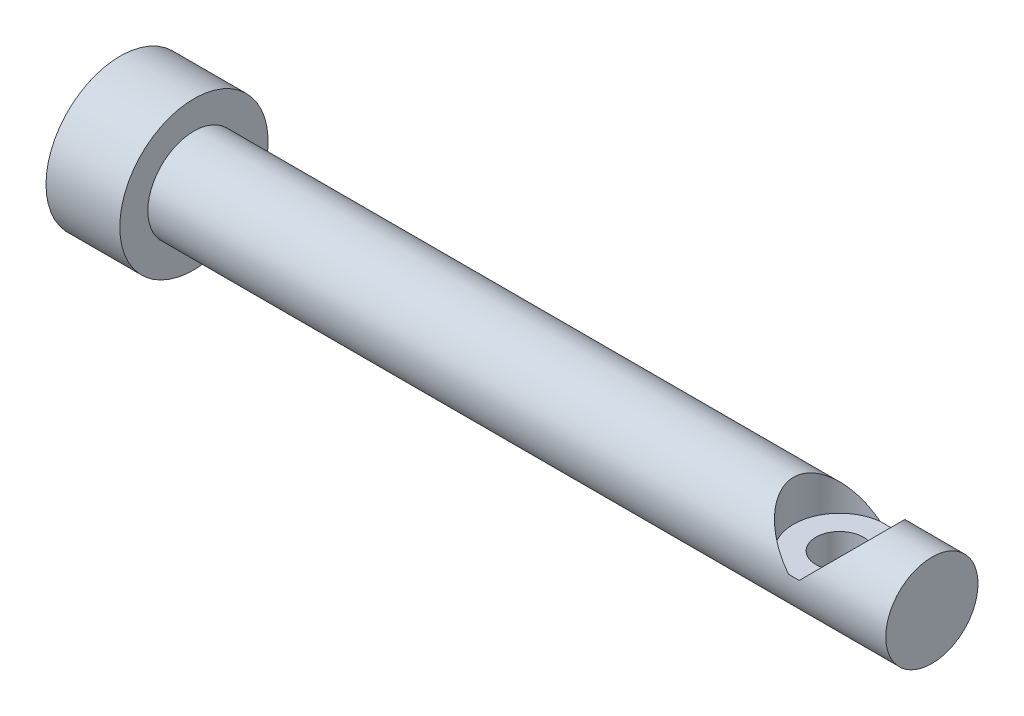
ISO-10303-21;
HEADER;
FILE_DESCRIPTION(('STEP AP214'),'2;1');
FILE_NAME('part.step','',(''),(''),'','','');
FILE_SCHEMA(('AUTOMOTIVE_DESIGN { 1 0 10303 214 1 1 1 1 }'));
ENDSEC;
DATA;
#1=APPLICATION_CONTEXT('core data for automotive mechanical design processes');
#2=APPLICATION_PROTOCOL_DEFINITION('international standard','automotive_design',2000,#1);
#3=PRODUCT_CONTEXT('',#1,'mechanical');
#4=PRODUCT('Part','Part','',(#3));
#5=PRODUCT_RELATED_PRODUCT_CATEGORY('part','',(#4));
#6=PRODUCT_DEFINITION_FORMATION('','',#4);
#7=PRODUCT_DEFINITION_CONTEXT('part definition',#1,'design');
#8=PRODUCT_DEFINITION('design','',#6,#7);
#9=PRODUCT_DEFINITION_SHAPE('','',#8);
#10=(LENGTH_UNIT() NAMED_UNIT(*) SI_UNIT(.MILLI.,.METRE.));
#11=(NAMED_UNIT(*) PLANE_ANGLE_UNIT() SI_UNIT($,.RADIAN.));
#12=(NAMED_UNIT(*) SI_UNIT($,.STERADIAN.) SOLID_ANGLE_UNIT());
#13=UNCERTAINTY_MEASURE_WITH_UNIT(LENGTH_MEASURE(1.E-05),#10,'distance_accuracy_value','');
#14=(GEOMETRIC_REPRESENTATION_CONTEXT(3) GLOBAL_UNCERTAINTY_ASSIGNED_CONTEXT((#13)) GLOBAL_UNIT_ASSIGNED_CONTEXT((#10,
#11,#12)) REPRESENTATION_CONTEXT('',''));
#15=CARTESIAN_POINT('',(0.,0.,0.));
#16=DIRECTION('',(0.,0.,1.));
#17=DIRECTION('',(1.,0.,0.));
#18=AXIS2_PLACEMENT_3D('',#15,#16,#17);
#19=CARTESIAN_POINT('',(-46.0375,40.64,0.));
#20=DIRECTION('',(1.,0.,0.));
#21=DIRECTION('',(0.,0.,-1.));
#22=AXIS2_PLACEMENT_3D('',#19,#20,#21);
#23=PLANE('',#22);
#24=CARTESIAN_POINT('',(-46.0375,40.64,0.));
#25=DIRECTION('',(-1.,0.,0.));
#26=DIRECTION('',(0.,0.,1.));
#27=AXIS2_PLACEMENT_3D('',#24,#25,#26);
#28=CIRCLE('',#27,6.38174999999998);
#29=CARTESIAN_POINT('',(-46.0375,40.64,6.38174999999998));
#30=VERTEX_POINT('',#29);
#31=EDGE_CURVE('E101',#30,#30,#28,.T.);
#32=ORIENTED_EDGE('',*,*,#31,.T.);
#33=EDGE_LOOP('',(#32));
#34=FACE_BOUND('',#33,.T.);
#35=ADVANCED_FACE('F42',(#34),#23,.F.);
#36=CARTESIAN_POINT('',(-56.202964930825,40.64,0.));
#37=DIRECTION('',(-1.,0.,0.));
#38=DIRECTION('',(0.,0.,1.));
#39=AXIS2_PLACEMENT_3D('',#36,#37,#38);
#40=CYLINDRICAL_SURFACE('',#39,6.38174999999998);
#41=ORIENTED_EDGE('',*,*,#31,.F.);
#42=EDGE_LOOP('',(#41));
#43=FACE_BOUND('',#42,.T.);
#44=CARTESIAN_POINT('',(-39.6875,40.64,0.));
#45=DIRECTION('',(-1.,0.,0.));
#46=DIRECTION('',(0.,0.,1.));
#47=AXIS2_PLACEMENT_3D('',#44,#45,#46);
#48=CIRCLE('',#47,6.38174999999998);
#49=CARTESIAN_POINT('',(-39.6875,40.64,6.38174999999998));
#50=VERTEX_POINT('',#49);
#51=EDGE_CURVE('E107',#50,#50,#48,.T.);
#52=ORIENTED_EDGE('',*,*,#51,.T.);
#53=EDGE_LOOP('',(#52));
#54=FACE_BOUND('',#53,.T.);
#55=ADVANCED_FACE('F139',(#43,#54),#40,.T.);
#56=CARTESIAN_POINT('',(-39.6875,47.02175,0.));
#57=DIRECTION('',(-1.,0.,0.));
#58=DIRECTION('',(0.,0.,1.));
#59=AXIS2_PLACEMENT_3D('',#56,#57,#58);
#60=PLANE('',#59);
#61=ORIENTED_EDGE('',*,*,#51,.F.);
#62=EDGE_LOOP('',(#61));
#63=FACE_BOUND('',#62,.T.);
#64=CARTESIAN_POINT('',(-39.6875,40.64,0.));
#65=DIRECTION('',(-1.,0.,0.));
#66=DIRECTION('',(0.,0.,1.));
#67=AXIS2_PLACEMENT_3D('',#64,#65,#66);
#68=CIRCLE('',#67,3.96875);
#69=CARTESIAN_POINT('',(-39.6875,40.64,3.96875));
#70=VERTEX_POINT('',#69);
#71=EDGE_CURVE('E111',#70,#70,#68,.T.);
#72=ORIENTED_EDGE('',*,*,#71,.T.);
#73=EDGE_LOOP('',(#72));
#74=FACE_BOUND('',#73,.T.);
#75=ADVANCED_FACE('F132',(#63,#74),#60,.F.);
#76=CARTESIAN_POINT('',(-56.202964930825,40.64,0.));
#77=DIRECTION('',(-1.,0.,0.));
#78=DIRECTION('',(0.,0.,1.));
#79=AXIS2_PLACEMENT_3D('',#76,#77,#78);
#80=CYLINDRICAL_SURFACE('',#79,3.96875);
#81=CARTESIAN_POINT('',(15.8749999999976,37.2385034951409,2.04469999998323));
#82=CARTESIAN_POINT('',(15.9810296673809,37.2384921446181,2.04469095313278));
#83=CARTESIAN_POINT('',(16.087186049216,37.2334689304662,2.03639610747318));
#84=CARTESIAN_POINT('',(16.296196619013,37.2141166192886,2.00365574002861));
#85=CARTESIAN_POINT('',(16.3990438733391,37.1997691684103,1.97917836285914));
#86=CARTESIAN_POINT('',(16.5980157573345,37.1638826984057,1.91543778523076));
#87=CARTESIAN_POINT('',(16.6941743983987,37.1423838616728,1.87625704619408));
#88=CARTESIAN_POINT('',(16.8785268322763,37.0946797008581,1.78447410838844));
#89=CARTESIAN_POINT('',(16.9667197856267,37.0684738815993,1.73187049728101));
#90=CARTESIAN_POINT('',(17.1411862074223,37.0114993608057,1.60931969969034));
#91=CARTESIAN_POINT('',(17.2266099439618,36.9805320578099,1.53825463857101));
#92=CARTESIAN_POINT('',(17.3849933927587,36.9191232655558,1.38311810546774));
#93=CARTESIAN_POINT('',(17.4579465495138,36.8886820603666,1.29903983671199));
#94=CARTESIAN_POINT('',(17.5945159369457,36.8291123566564,1.11280547865068));
#95=CARTESIAN_POINT('',(17.6570685598794,36.8002399622901,1.00977973458518));
#96=CARTESIAN_POINT('',(17.7635633236914,36.7496725657032,0.792899929535476));
#97=CARTESIAN_POINT('',(17.8075179218486,36.7279727612961,0.679053179441468));
#98=CARTESIAN_POINT('',(17.8721420002705,36.695632650431,0.452781116875787));
#99=CARTESIAN_POINT('',(17.894306878998,36.6842866921271,0.340886083819498));
#100=CARTESIAN_POINT('',(17.9196657820781,36.6712835055659,0.114436436252768));
#101=CARTESIAN_POINT('',(17.9228721094941,36.6696199939409,-0.000116405012391717));
#102=CARTESIAN_POINT('',(17.9107568968359,36.675851831025,-0.217308436998253));
#103=CARTESIAN_POINT('',(17.8971162400228,36.6828800609314,-0.320072337486711));
#104=CARTESIAN_POINT('',(17.85472846694,36.7043716883468,-0.521611273963975));
#105=CARTESIAN_POINT('',(17.8259802134925,36.7188356455555,-0.620386009077913));
#106=CARTESIAN_POINT('',(17.7540561012209,36.7541231749749,-0.812797918909218));
#107=CARTESIAN_POINT('',(17.7106962624683,36.7750275374008,-0.906350890685685));
#108=CARTESIAN_POINT('',(17.6110599043365,36.8213433716821,-1.08506826469671));
#109=CARTESIAN_POINT('',(17.5547788721154,36.846756417529,-1.17022972123312));
#110=CARTESIAN_POINT('',(17.4245314425793,36.9026972596255,-1.33872378517888));
#111=CARTESIAN_POINT('',(17.3493676607973,36.9334823173808,-1.42104595309194));
#112=CARTESIAN_POINT('',(17.1866688453255,36.9951427555445,-1.57247922097055));
#113=CARTESIAN_POINT('',(17.0991233861343,37.0260181903739,-1.64157907104056));
#114=CARTESIAN_POINT('',(16.9066337204245,37.0867566365551,-1.76940511193604));
#115=CARTESIAN_POINT('',(16.8008982674859,37.1163950705032,-1.82705748016625));
#116=CARTESIAN_POINT('',(16.5793736535943,37.1679991456395,-1.92332995323159));
#117=CARTESIAN_POINT('',(16.4635956231188,37.1899731492171,-1.96197081987108));
#118=CARTESIAN_POINT('',(16.2350232726814,37.2212207102512,-2.01589452613062));
#119=CARTESIAN_POINT('',(16.1227388113369,37.2313741259031,-2.03280704003834));
#120=CARTESIAN_POINT('',(15.89650715938,37.2403069028891,-2.0477197651732));
#121=CARTESIAN_POINT('',(15.7825613983416,37.2390955265182,-2.04573537733814));
#122=CARTESIAN_POINT('',(15.570809427422,37.2263712574831,-2.02440636440867));
#123=CARTESIAN_POINT('',(15.472702946485,37.2161078690335,-2.00716660258606));
#124=CARTESIAN_POINT('',(15.2809868701294,37.188330490582,-1.95901019400936));
#125=CARTESIAN_POINT('',(15.1873788676384,37.170813953022,-1.92808874150792));
#126=CARTESIAN_POINT('',(15.0024188199655,37.1295780930162,-1.85198821084725));
#127=CARTESIAN_POINT('',(14.9113656418786,37.1056117713315,-1.80622185245023));
#128=CARTESIAN_POINT('',(14.7376959676823,37.0543702512894,-1.70223225881659));
#129=CARTESIAN_POINT('',(14.6550838484531,37.027093352199,-1.64400260902257));
#130=CARTESIAN_POINT('',(14.4889256677509,36.9678670598767,-1.50753526476157));
#131=CARTESIAN_POINT('',(14.4067688946653,36.9357852350484,-1.42765577686862));
#132=CARTESIAN_POINT('',(14.2565537365266,36.8737200640767,-1.25480860925901));
#133=CARTESIAN_POINT('',(14.1885010799828,36.8437375738571,-1.16183563715841));
#134=CARTESIAN_POINT('',(14.066464796352,36.7879963402883,-0.961355917540092));
#135=CARTESIAN_POINT('',(14.0130168404471,36.7624087239895,-0.853472034547112));
#136=CARTESIAN_POINT('',(13.9255774638542,36.7196731377082,-0.628546536239697));
#137=CARTESIAN_POINT('',(13.8915679506736,36.7025173218481,-0.511513552266631));
#138=CARTESIAN_POINT('',(13.847064186612,36.6799019644443,-0.283630061133085));
#139=CARTESIAN_POINT('',(13.834640035196,36.6734846800949,-0.1732511628982));
#140=CARTESIAN_POINT('',(13.8278726978904,36.6700005904311,0.048190322662984));
#141=CARTESIAN_POINT('',(13.8335223424765,36.6729300774326,0.159252621452301));
#142=CARTESIAN_POINT('',(13.86151318993,36.6872562606117,0.370386422018556));
#143=CARTESIAN_POINT('',(13.8826122208328,36.6980224987448,0.470670300698684));
#144=CARTESIAN_POINT('',(13.9391595757266,36.7262986185031,0.666086288487658));
#145=CARTESIAN_POINT('',(13.9746098421702,36.7438094129945,0.761217698228142));
#146=CARTESIAN_POINT('',(14.0603207302754,36.7849034280803,0.948012762873163));
#147=CARTESIAN_POINT('',(14.1111264133395,36.8087051807866,1.03937675205056));
#148=CARTESIAN_POINT('',(14.2254293464307,36.8599667173967,1.21264251753973));
#149=CARTESIAN_POINT('',(14.288932319184,36.8874281488663,1.29454000089368));
#150=CARTESIAN_POINT('',(14.4345173007882,36.9467221414441,1.45560557197455));
#151=CARTESIAN_POINT('',(14.5178482446944,36.9787113681171,1.53359074406877));
#152=CARTESIAN_POINT('',(14.6967130149886,37.0411809557968,1.67495141726793));
#153=CARTESIAN_POINT('',(14.7922586765726,37.0716598130832,1.73831257945444));
#154=CARTESIAN_POINT('',(14.9980891276404,37.1287257641663,1.85097345038523));
#155=CARTESIAN_POINT('',(15.1088197538069,37.1551000638929,1.89958411553395));
#156=CARTESIAN_POINT('',(15.2810104703394,37.187492195497,1.95745939789621));
#157=CARTESIAN_POINT('',(15.3393685583633,37.1970893266706,1.97423611508808));
#158=CARTESIAN_POINT('',(15.4577033718036,37.2135012529178,2.00258679582263));
#159=CARTESIAN_POINT('',(15.5176789614357,37.220317948793,2.01416431426585));
#160=CARTESIAN_POINT('',(15.6271829091082,37.2298375938362,2.03023117277375));
#161=CARTESIAN_POINT('',(15.6765305850075,37.2330761384499,2.03564943531788));
#162=CARTESIAN_POINT('',(15.7755762024996,37.2374118191843,2.04288608546702));
#163=CARTESIAN_POINT('',(15.8252741662958,37.2385088183134,2.04470424277859));
#164=CARTESIAN_POINT('',(15.8749999999976,37.2385034951409,2.04469999998323));
#165=B_SPLINE_CURVE_WITH_KNOTS('',3,(#81,#82,#83,#84,#85,#86,#87,#88,#89,#90,#91,#92,#93,#94,
#95,#96,#97,#98,#99,#100,#101,#102,#103,#104,#105,#106,#107,#108,#109,#110,#111,#112,#113,#114,
#115,#116,#117,#118,#119,#120,#121,#122,#123,#124,#125,#126,#127,#128,#129,#130,#131,#132,#133,
#134,#135,#136,#137,#138,#139,#140,#141,#142,#143,#144,#145,#146,#147,#148,#149,#150,#151,#152,
#153,#154,#155,#156,#157,#158,#159,#160,#161,#162,#163,#164),.UNSPECIFIED.,.T.,.F.,(4,2,2,2,2,2,
2,2,2,2,2,2,2,2,2,2,2,2,2,2,2,2,2,2,2,2,2,2,2,2,2,2,2,2,2,2,2,2,2,2,2,4),(0.,0.317887197224384,
0.636402027478961,0.953156586014666,1.26994448683744,1.6145706664873,1.95937745491296,
2.32923846287314,2.69885133783553,3.04082603088624,3.38257877667745,3.69282438947972,
4.00309335840678,4.3174248492911,4.63186629070496,4.97734842559369,5.32312321134138,
5.6932585486521,6.06298877174803,6.40296098492941,6.7426561451537,7.04172007117901,
7.34088912807315,7.65373769333344,7.96674766310522,8.32215674363977,8.67770989498329,
9.04494424094496,9.41183622152008,9.74381134271512,10.075654792152,10.3833952855153,
10.6911774457672,11.0115122332062,11.3319917237556,11.6860154254853,12.0403847884743,
12.4093938497264,12.5935710006009,12.7776220297253,12.9266953525869,13.0757782111415),.UNSPECIFIED.);
#166=CARTESIAN_POINT('',(15.8749999999976,37.2385034951409,2.04469999998323));
#167=VERTEX_POINT('',#166);
#168=EDGE_CURVE('E45',#167,#167,#165,.T.);
#169=ORIENTED_EDGE('',*,*,#168,.T.);
#170=EDGE_LOOP('',(#169));
#171=FACE_BOUND('',#170,.T.);
#172=DIRECTION('',(-1.,0.,0.));
#173=VECTOR('',#172,1.);
#174=CARTESIAN_POINT('',(-56.202964930825,41.10355,-3.94158571643444));
#175=LINE('',#174,#173);
#176=CARTESIAN_POINT('',(15.4114499999976,41.10355,-3.94158571644702));
#177=VERTEX_POINT('',#176);
#178=CARTESIAN_POINT('',(16.3385499999976,41.10355,-3.94158571644702));
#179=VERTEX_POINT('',#178);
#180=EDGE_CURVE('E88',#177,#179,#175,.F.);
#181=ORIENTED_EDGE('',*,*,#180,.T.);
#182=CARTESIAN_POINT('',(15.8749999999976,40.64,-8.38565328287189E-12));
#183=DIRECTION('',(-0.707106781186547,0.707106781186547,0.));
#184=DIRECTION('',(-0.707106781186547,-0.707106781186547,0.));
#185=AXIS2_PLACEMENT_3D('',#182,#183,#184);
#186=ELLIPSE('',#185,5.61266007566822,3.96875);
#187=CARTESIAN_POINT('',(16.3385499999976,41.10355,3.94158571642186));
#188=VERTEX_POINT('',#187);
#189=EDGE_CURVE('E11',#179,#188,#186,.F.);
#190=ORIENTED_EDGE('',*,*,#189,.T.);
#191=DIRECTION('',(-1.,0.,0.));
#192=VECTOR('',#191,1.);
#193=CARTESIAN_POINT('',(-56.202964930825,41.10355,3.94158571643444));
#194=LINE('',#193,#192);
#195=CARTESIAN_POINT('',(15.4114499999976,41.10355,3.94158571642186));
#196=VERTEX_POINT('',#195);
#197=EDGE_CURVE('E56',#188,#196,#194,.T.);
#198=ORIENTED_EDGE('',*,*,#197,.T.);
#199=CARTESIAN_POINT('',(15.8749999999976,40.64,-8.38565328287189E-12));
#200=DIRECTION('',(-0.707106781186547,-0.707106781186547,0.));
#201=DIRECTION('',(-0.707106781186547,0.707106781186547,0.));
#202=AXIS2_PLACEMENT_3D('',#199,#200,#201);
#203=ELLIPSE('',#202,5.61266007566822,3.96875);
#204=EDGE_CURVE('E71',#196,#177,#203,.T.);
#205=ORIENTED_EDGE('',*,*,#204,.T.);
#206=EDGE_LOOP('',(#181,#190,#198,#205));
#207=FACE_BOUND('',#206,.T.);
#208=ORIENTED_EDGE('',*,*,#71,.F.);
#209=EDGE_LOOP('',(#208));
#210=FACE_BOUND('',#209,.T.);
#211=CARTESIAN_POINT('',(23.8125,40.64,0.));
#212=DIRECTION('',(1.,0.,0.));
#213=DIRECTION('',(0.,0.,-1.));
#214=AXIS2_PLACEMENT_3D('',#211,#212,#213);
#215=CIRCLE('',#214,3.96875000000001);
#216=CARTESIAN_POINT('',(23.8125,40.64,-3.96875000000001));
#217=VERTEX_POINT('',#216);
#218=EDGE_CURVE('E118',#217,#217,#215,.T.);
#219=ORIENTED_EDGE('',*,*,#218,.F.);
#220=EDGE_LOOP('',(#219));
#221=FACE_BOUND('',#220,.T.);
#222=ADVANCED_FACE('F95',(#171,#207,#210,#221),#80,.T.);
#223=CARTESIAN_POINT('',(15.8749999999976,44.60875,-1.67713065657438E-11));
#224=DIRECTION('',(0.,1.,0.));
#225=DIRECTION('',(0.,0.,1.));
#226=AXIS2_PLACEMENT_3D('',#223,#224,#225);
#227=CYLINDRICAL_SURFACE('',#226,2.0447);
#228=CARTESIAN_POINT('',(15.8749999999976,41.10355,-1.67713065657438E-11));
#229=DIRECTION('',(0.,1.,0.));
#230=DIRECTION('',(0.,0.,1.));
#231=AXIS2_PLACEMENT_3D('',#228,#229,#230);
#232=CIRCLE('',#231,2.0447);
#233=CARTESIAN_POINT('',(15.8749999999976,41.10355,2.04469999998323));
#234=VERTEX_POINT('',#233);
#235=EDGE_CURVE('E93',#234,#234,#232,.T.);
#236=ORIENTED_EDGE('',*,*,#235,.T.);
#237=EDGE_LOOP('',(#236));
#238=FACE_BOUND('',#237,.T.);
#239=ORIENTED_EDGE('',*,*,#168,.F.);
#240=EDGE_LOOP('',(#239));
#241=FACE_BOUND('',#240,.T.);
#242=ADVANCED_FACE('F131',(#238,#241),#227,.F.);
#243=CARTESIAN_POINT('',(17.9196999999976,41.10355,-1.67713065657438E-11));
#244=DIRECTION('',(0.,-1.,0.));
#245=DIRECTION('',(0.,0.,-1.));
#246=AXIS2_PLACEMENT_3D('',#243,#244,#245);
#247=PLANE('',#246);
#248=ORIENTED_EDGE('',*,*,#235,.F.);
#249=EDGE_LOOP('',(#248));
#250=FACE_BOUND('',#249,.T.);
#251=CARTESIAN_POINT('',(15.8749999999976,41.10355,-1.67713065657438E-11));
#252=DIRECTION('',(0.,1.,0.));
#253=DIRECTION('',(0.,0.,1.));
#254=AXIS2_PLACEMENT_3D('',#251,#252,#253);
#255=CIRCLE('',#254,3.96875);
#256=EDGE_CURVE('E84',#188,#179,#255,.T.);
#257=ORIENTED_EDGE('',*,*,#256,.T.);
#258=ORIENTED_EDGE('',*,*,#180,.F.);
#259=EDGE_CURVE('E65',#177,#196,#255,.T.);
#260=ORIENTED_EDGE('',*,*,#259,.T.);
#261=ORIENTED_EDGE('',*,*,#197,.F.);
#262=EDGE_LOOP('',(#257,#258,#260,#261));
#263=FACE_BOUND('',#262,.T.);
#264=ADVANCED_FACE('F83',(#250,#263),#247,.F.);
#265=CARTESIAN_POINT('',(15.8749999999976,44.60875,-1.67713065657438E-11));
#266=DIRECTION('',(0.,1.,0.));
#267=DIRECTION('',(0.,0.,1.));
#268=AXIS2_PLACEMENT_3D('',#265,#266,#267);
#269=CYLINDRICAL_SURFACE('',#268,3.96875);
#270=ORIENTED_EDGE('',*,*,#256,.F.);
#271=ORIENTED_EDGE('',*,*,#189,.F.);
#272=EDGE_LOOP('',(#270,#271));
#273=FACE_BOUND('',#272,.T.);
#274=ADVANCED_FACE('F91',(#273),#269,.F.);
#275=ORIENTED_EDGE('',*,*,#259,.F.);
#276=ORIENTED_EDGE('',*,*,#204,.F.);
#277=EDGE_LOOP('',(#275,#276));
#278=FACE_BOUND('',#277,.T.);
#279=ADVANCED_FACE('F192',(#278),#269,.F.);
#280=CARTESIAN_POINT('',(23.8125,40.64,0.));
#281=DIRECTION('',(1.,0.,0.));
#282=DIRECTION('',(0.,0.,-1.));
#283=AXIS2_PLACEMENT_3D('',#280,#281,#282);
#284=PLANE('',#283);
#285=ORIENTED_EDGE('',*,*,#218,.T.);
#286=EDGE_LOOP('',(#285));
#287=FACE_BOUND('',#286,.T.);
#288=ADVANCED_FACE('F128',(#287),#284,.T.);
#289=CLOSED_SHELL('',(#35,#55,#75,#222,#242,#264,#274,#279,#288));
#290=MANIFOLD_SOLID_BREP('B2',#289);
#291=ADVANCED_BREP_SHAPE_REPRESENTATION('',(#18,#290),#14);
#292=SHAPE_DEFINITION_REPRESENTATION(#9,#291);
ENDSEC;
END-ISO-10303-21;
